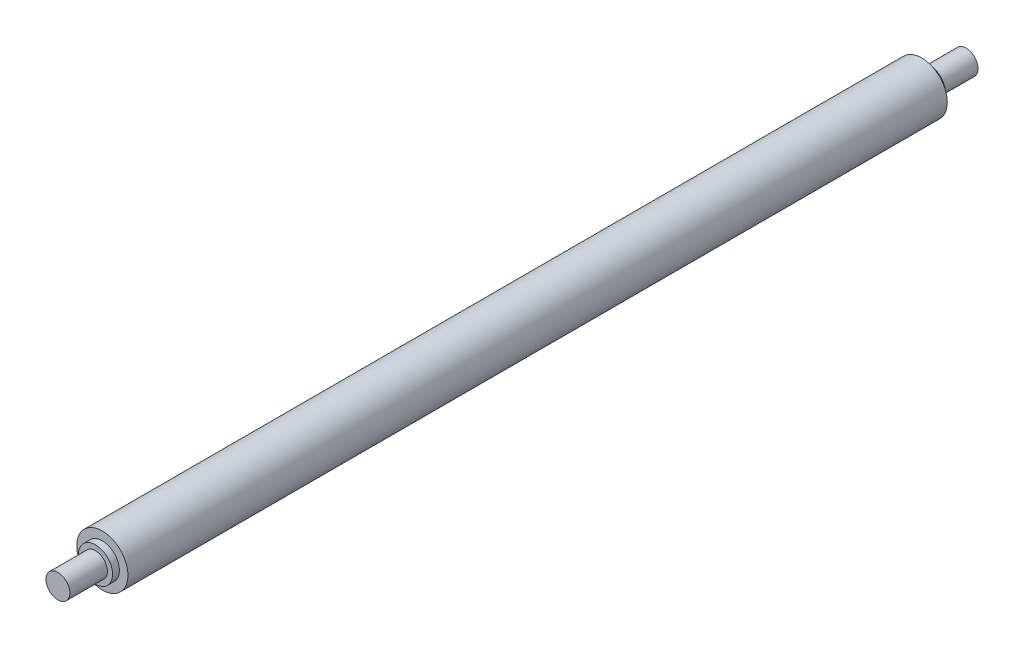
ISO-10303-21;
HEADER;
FILE_DESCRIPTION(('STEP AP214'),'2;1');
FILE_NAME('part.step','',(''),(''),'','','');
FILE_SCHEMA(('AUTOMOTIVE_DESIGN { 1 0 10303 214 1 1 1 1 }'));
ENDSEC;
DATA;
#1=APPLICATION_CONTEXT('core data for automotive mechanical design processes');
#2=APPLICATION_PROTOCOL_DEFINITION('international standard','automotive_design',2000,#1);
#3=PRODUCT_CONTEXT('',#1,'mechanical');
#4=PRODUCT('Part','Part','',(#3));
#5=PRODUCT_RELATED_PRODUCT_CATEGORY('part','',(#4));
#6=PRODUCT_DEFINITION_FORMATION('','',#4);
#7=PRODUCT_DEFINITION_CONTEXT('part definition',#1,'design');
#8=PRODUCT_DEFINITION('design','',#6,#7);
#9=PRODUCT_DEFINITION_SHAPE('','',#8);
#10=(LENGTH_UNIT() NAMED_UNIT(*) SI_UNIT(.MILLI.,.METRE.));
#11=(NAMED_UNIT(*) PLANE_ANGLE_UNIT() SI_UNIT($,.RADIAN.));
#12=(NAMED_UNIT(*) SI_UNIT($,.STERADIAN.) SOLID_ANGLE_UNIT());
#13=UNCERTAINTY_MEASURE_WITH_UNIT(LENGTH_MEASURE(1.E-05),#10,'distance_accuracy_value','');
#14=(GEOMETRIC_REPRESENTATION_CONTEXT(3) GLOBAL_UNCERTAINTY_ASSIGNED_CONTEXT((#13)) GLOBAL_UNIT_ASSIGNED_CONTEXT((#10,
#11,#12)) REPRESENTATION_CONTEXT('',''));
#15=CARTESIAN_POINT('',(0.,0.,0.));
#16=DIRECTION('',(0.,0.,1.));
#17=DIRECTION('',(1.,0.,0.));
#18=AXIS2_PLACEMENT_3D('',#15,#16,#17);
#19=CARTESIAN_POINT('',(0.,0.,240.));
#20=DIRECTION('',(0.,0.,-1.));
#21=DIRECTION('',(-1.,0.,0.));
#22=AXIS2_PLACEMENT_3D('',#19,#20,#21);
#23=CYLINDRICAL_SURFACE('',#22,7.5);
#24=CARTESIAN_POINT('',(0.,0.,240.));
#25=DIRECTION('',(0.,0.,1.));
#26=DIRECTION('',(1.,0.,0.));
#27=AXIS2_PLACEMENT_3D('',#24,#25,#26);
#28=CIRCLE('',#27,7.5);
#29=CARTESIAN_POINT('',(7.5,0.,240.));
#30=VERTEX_POINT('',#29);
#31=EDGE_CURVE('E40',#30,#30,#28,.T.);
#32=ORIENTED_EDGE('',*,*,#31,.F.);
#33=EDGE_LOOP('',(#32));
#34=FACE_BOUND('',#33,.T.);
#35=CARTESIAN_POINT('',(0.,0.,0.));
#36=DIRECTION('',(0.,0.,1.));
#37=DIRECTION('',(1.,0.,0.));
#38=AXIS2_PLACEMENT_3D('',#35,#36,#37);
#39=CIRCLE('',#38,7.5);
#40=CARTESIAN_POINT('',(7.5,0.,0.));
#41=VERTEX_POINT('',#40);
#42=EDGE_CURVE('E44',#41,#41,#39,.T.);
#43=ORIENTED_EDGE('',*,*,#42,.T.);
#44=EDGE_LOOP('',(#43));
#45=FACE_BOUND('',#44,.T.);
#46=ADVANCED_FACE('F33',(#34,#45),#23,.T.);
#47=CARTESIAN_POINT('',(0.,0.,240.));
#48=DIRECTION('',(0.,0.,1.));
#49=DIRECTION('',(1.,0.,0.));
#50=AXIS2_PLACEMENT_3D('',#47,#48,#49);
#51=PLANE('',#50);
#52=CARTESIAN_POINT('',(0.,0.,240.));
#53=DIRECTION('',(0.,0.,1.));
#54=DIRECTION('',(1.,0.,0.));
#55=AXIS2_PLACEMENT_3D('',#52,#53,#54);
#56=CIRCLE('',#55,5.);
#57=CARTESIAN_POINT('',(5.,0.,240.));
#58=VERTEX_POINT('',#57);
#59=EDGE_CURVE('E61',#58,#58,#56,.T.);
#60=ORIENTED_EDGE('',*,*,#59,.F.);
#61=EDGE_LOOP('',(#60));
#62=FACE_BOUND('',#61,.T.);
#63=ORIENTED_EDGE('',*,*,#31,.T.);
#64=EDGE_LOOP('',(#63));
#65=FACE_BOUND('',#64,.T.);
#66=ADVANCED_FACE('F89',(#62,#65),#51,.T.);
#67=CARTESIAN_POINT('',(0.,0.,0.));
#68=DIRECTION('',(0.,0.,1.));
#69=DIRECTION('',(1.,0.,0.));
#70=AXIS2_PLACEMENT_3D('',#67,#68,#69);
#71=PLANE('',#70);
#72=CARTESIAN_POINT('',(0.,0.,0.));
#73=DIRECTION('',(0.,0.,1.));
#74=DIRECTION('',(1.,0.,0.));
#75=AXIS2_PLACEMENT_3D('',#72,#73,#74);
#76=CIRCLE('',#75,5.);
#77=CARTESIAN_POINT('',(5.,0.,0.));
#78=VERTEX_POINT('',#77);
#79=EDGE_CURVE('E10',#78,#78,#76,.F.);
#80=ORIENTED_EDGE('',*,*,#79,.F.);
#81=EDGE_LOOP('',(#80));
#82=FACE_BOUND('',#81,.T.);
#83=ORIENTED_EDGE('',*,*,#42,.F.);
#84=EDGE_LOOP('',(#83));
#85=FACE_BOUND('',#84,.T.);
#86=ADVANCED_FACE('F95',(#82,#85),#71,.F.);
#87=CARTESIAN_POINT('',(0.,0.,-2.));
#88=DIRECTION('',(0.,0.,1.));
#89=DIRECTION('',(1.,0.,0.));
#90=AXIS2_PLACEMENT_3D('',#87,#88,#89);
#91=CYLINDRICAL_SURFACE('',#90,5.);
#92=CARTESIAN_POINT('',(0.,0.,-2.));
#93=DIRECTION('',(0.,0.,-1.));
#94=DIRECTION('',(-1.,0.,0.));
#95=AXIS2_PLACEMENT_3D('',#92,#93,#94);
#96=CIRCLE('',#95,5.);
#97=CARTESIAN_POINT('',(-5.,0.,-2.));
#98=VERTEX_POINT('',#97);
#99=EDGE_CURVE('E51',#98,#98,#96,.T.);
#100=ORIENTED_EDGE('',*,*,#99,.F.);
#101=EDGE_LOOP('',(#100));
#102=FACE_BOUND('',#101,.T.);
#103=ORIENTED_EDGE('',*,*,#79,.T.);
#104=EDGE_LOOP('',(#103));
#105=FACE_BOUND('',#104,.T.);
#106=ADVANCED_FACE('F103',(#102,#105),#91,.T.);
#107=CARTESIAN_POINT('',(0.,0.,-2.));
#108=DIRECTION('',(0.,0.,-1.));
#109=DIRECTION('',(-1.,0.,0.));
#110=AXIS2_PLACEMENT_3D('',#107,#108,#109);
#111=PLANE('',#110);
#112=CARTESIAN_POINT('',(0.,0.,-2.));
#113=DIRECTION('',(0.,0.,-1.));
#114=DIRECTION('',(-1.,0.,0.));
#115=AXIS2_PLACEMENT_3D('',#112,#113,#114);
#116=CIRCLE('',#115,3.5);
#117=CARTESIAN_POINT('',(-3.5,0.,-2.));
#118=VERTEX_POINT('',#117);
#119=EDGE_CURVE('E47',#118,#118,#116,.T.);
#120=ORIENTED_EDGE('',*,*,#119,.F.);
#121=EDGE_LOOP('',(#120));
#122=FACE_BOUND('',#121,.T.);
#123=ORIENTED_EDGE('',*,*,#99,.T.);
#124=EDGE_LOOP('',(#123));
#125=FACE_BOUND('',#124,.T.);
#126=ADVANCED_FACE('F110',(#122,#125),#111,.T.);
#127=CARTESIAN_POINT('',(0.,0.,-13.));
#128=DIRECTION('',(0.,0.,-1.));
#129=DIRECTION('',(-1.,0.,0.));
#130=AXIS2_PLACEMENT_3D('',#127,#128,#129);
#131=PLANE('',#130);
#132=CARTESIAN_POINT('',(0.,0.,-13.));
#133=DIRECTION('',(0.,0.,-1.));
#134=DIRECTION('',(-1.,0.,0.));
#135=AXIS2_PLACEMENT_3D('',#132,#133,#134);
#136=CIRCLE('',#135,3.5);
#137=CARTESIAN_POINT('',(-3.5,0.,-13.));
#138=VERTEX_POINT('',#137);
#139=EDGE_CURVE('E53',#138,#138,#136,.T.);
#140=ORIENTED_EDGE('',*,*,#139,.T.);
#141=EDGE_LOOP('',(#140));
#142=FACE_BOUND('',#141,.T.);
#143=ADVANCED_FACE('F116',(#142),#131,.T.);
#144=CARTESIAN_POINT('',(0.,0.,-13.));
#145=DIRECTION('',(0.,0.,1.));
#146=DIRECTION('',(1.,0.,0.));
#147=AXIS2_PLACEMENT_3D('',#144,#145,#146);
#148=CYLINDRICAL_SURFACE('',#147,3.5);
#149=ORIENTED_EDGE('',*,*,#119,.T.);
#150=EDGE_LOOP('',(#149));
#151=FACE_BOUND('',#150,.T.);
#152=ORIENTED_EDGE('',*,*,#139,.F.);
#153=EDGE_LOOP('',(#152));
#154=FACE_BOUND('',#153,.T.);
#155=ADVANCED_FACE('F85',(#151,#154),#148,.T.);
#156=CARTESIAN_POINT('',(0.,0.,242.));
#157=DIRECTION('',(0.,0.,-1.));
#158=DIRECTION('',(-1.,0.,0.));
#159=AXIS2_PLACEMENT_3D('',#156,#157,#158);
#160=CYLINDRICAL_SURFACE('',#159,5.);
#161=CARTESIAN_POINT('',(0.,0.,242.));
#162=DIRECTION('',(0.,0.,1.));
#163=DIRECTION('',(1.,0.,0.));
#164=AXIS2_PLACEMENT_3D('',#161,#162,#163);
#165=CIRCLE('',#164,5.);
#166=CARTESIAN_POINT('',(5.,0.,242.));
#167=VERTEX_POINT('',#166);
#168=EDGE_CURVE('E64',#167,#167,#165,.T.);
#169=ORIENTED_EDGE('',*,*,#168,.F.);
#170=EDGE_LOOP('',(#169));
#171=FACE_BOUND('',#170,.T.);
#172=ORIENTED_EDGE('',*,*,#59,.T.);
#173=EDGE_LOOP('',(#172));
#174=FACE_BOUND('',#173,.T.);
#175=ADVANCED_FACE('F77',(#171,#174),#160,.T.);
#176=CARTESIAN_POINT('',(0.,0.,242.));
#177=DIRECTION('',(0.,0.,1.));
#178=DIRECTION('',(1.,0.,0.));
#179=AXIS2_PLACEMENT_3D('',#176,#177,#178);
#180=PLANE('',#179);
#181=CARTESIAN_POINT('',(0.,0.,242.));
#182=DIRECTION('',(0.,0.,1.));
#183=DIRECTION('',(1.,0.,0.));
#184=AXIS2_PLACEMENT_3D('',#181,#182,#183);
#185=CIRCLE('',#184,3.5);
#186=CARTESIAN_POINT('',(3.5,0.,242.));
#187=VERTEX_POINT('',#186);
#188=EDGE_CURVE('E36',#187,#187,#185,.T.);
#189=ORIENTED_EDGE('',*,*,#188,.F.);
#190=EDGE_LOOP('',(#189));
#191=FACE_BOUND('',#190,.T.);
#192=ORIENTED_EDGE('',*,*,#168,.T.);
#193=EDGE_LOOP('',(#192));
#194=FACE_BOUND('',#193,.T.);
#195=ADVANCED_FACE('F74',(#191,#194),#180,.T.);
#196=CARTESIAN_POINT('',(0.,0.,253.));
#197=DIRECTION('',(0.,0.,1.));
#198=DIRECTION('',(1.,0.,0.));
#199=AXIS2_PLACEMENT_3D('',#196,#197,#198);
#200=PLANE('',#199);
#201=CARTESIAN_POINT('',(0.,0.,253.));
#202=DIRECTION('',(0.,0.,1.));
#203=DIRECTION('',(1.,0.,0.));
#204=AXIS2_PLACEMENT_3D('',#201,#202,#203);
#205=CIRCLE('',#204,3.5);
#206=CARTESIAN_POINT('',(3.5,0.,253.));
#207=VERTEX_POINT('',#206);
#208=EDGE_CURVE('E50',#207,#207,#205,.T.);
#209=ORIENTED_EDGE('',*,*,#208,.T.);
#210=EDGE_LOOP('',(#209));
#211=FACE_BOUND('',#210,.T.);
#212=ADVANCED_FACE('F76',(#211),#200,.T.);
#213=CARTESIAN_POINT('',(0.,0.,253.));
#214=DIRECTION('',(0.,0.,-1.));
#215=DIRECTION('',(-1.,0.,0.));
#216=AXIS2_PLACEMENT_3D('',#213,#214,#215);
#217=CYLINDRICAL_SURFACE('',#216,3.5);
#218=ORIENTED_EDGE('',*,*,#188,.T.);
#219=EDGE_LOOP('',(#218));
#220=FACE_BOUND('',#219,.T.);
#221=ORIENTED_EDGE('',*,*,#208,.F.);
#222=EDGE_LOOP('',(#221));
#223=FACE_BOUND('',#222,.T.);
#224=ADVANCED_FACE('F71',(#220,#223),#217,.T.);
#225=CLOSED_SHELL('',(#46,#66,#86,#106,#126,#143,#155,#175,#195,#212,#224));
#226=MANIFOLD_SOLID_BREP('B2',#225);
#227=ADVANCED_BREP_SHAPE_REPRESENTATION('',(#18,#226),#14);
#228=SHAPE_DEFINITION_REPRESENTATION(#9,#227);
ENDSEC;
END-ISO-10303-21;
